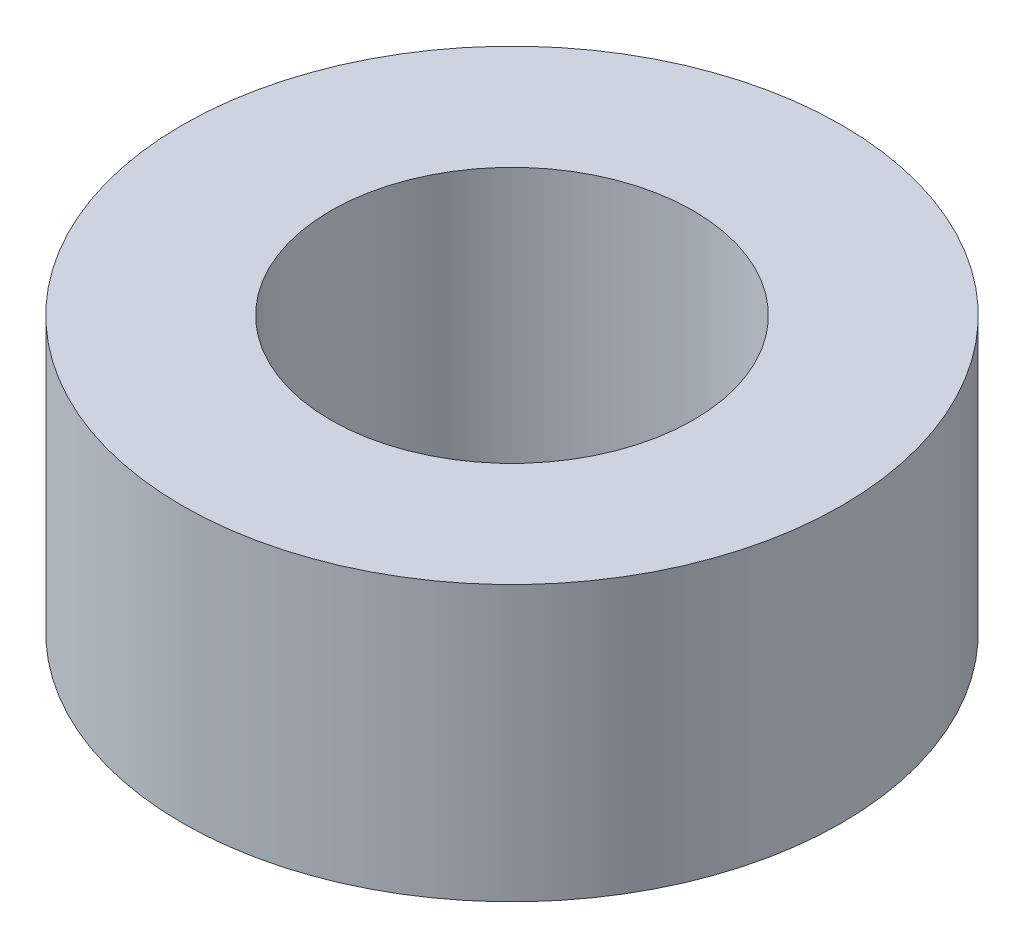
ISO-10303-21;
HEADER;
FILE_DESCRIPTION(('STEP AP214'),'2;1');
FILE_NAME('part.step','',(''),(''),'','','');
FILE_SCHEMA(('AUTOMOTIVE_DESIGN { 1 0 10303 214 1 1 1 1 }'));
ENDSEC;
DATA;
#1=APPLICATION_CONTEXT('core data for automotive mechanical design processes');
#2=APPLICATION_PROTOCOL_DEFINITION('international standard','automotive_design',2000,#1);
#3=PRODUCT_CONTEXT('',#1,'mechanical');
#4=PRODUCT('Part','Part','',(#3));
#5=PRODUCT_RELATED_PRODUCT_CATEGORY('part','',(#4));
#6=PRODUCT_DEFINITION_FORMATION('','',#4);
#7=PRODUCT_DEFINITION_CONTEXT('part definition',#1,'design');
#8=PRODUCT_DEFINITION('design','',#6,#7);
#9=PRODUCT_DEFINITION_SHAPE('','',#8);
#10=(LENGTH_UNIT() NAMED_UNIT(*) SI_UNIT(.MILLI.,.METRE.));
#11=(NAMED_UNIT(*) PLANE_ANGLE_UNIT() SI_UNIT($,.RADIAN.));
#12=(NAMED_UNIT(*) SI_UNIT($,.STERADIAN.) SOLID_ANGLE_UNIT());
#13=UNCERTAINTY_MEASURE_WITH_UNIT(LENGTH_MEASURE(1.E-05),#10,'distance_accuracy_value','');
#14=(GEOMETRIC_REPRESENTATION_CONTEXT(3) GLOBAL_UNCERTAINTY_ASSIGNED_CONTEXT((#13)) GLOBAL_UNIT_ASSIGNED_CONTEXT((#10,
#11,#12)) REPRESENTATION_CONTEXT('',''));
#15=CARTESIAN_POINT('',(0.,0.,0.));
#16=DIRECTION('',(0.,0.,1.));
#17=DIRECTION('',(1.,0.,0.));
#18=AXIS2_PLACEMENT_3D('',#15,#16,#17);
#19=CARTESIAN_POINT('',(0.,5.,0.));
#20=DIRECTION('',(0.,1.,0.));
#21=DIRECTION('',(0.,0.,1.));
#22=AXIS2_PLACEMENT_3D('',#19,#20,#21);
#23=PLANE('',#22);
#24=CARTESIAN_POINT('',(0.,5.,0.));
#25=DIRECTION('',(0.,1.,0.));
#26=DIRECTION('',(0.,0.,1.));
#27=AXIS2_PLACEMENT_3D('',#24,#25,#26);
#28=CIRCLE('',#27,6.);
#29=CARTESIAN_POINT('',(0.,5.,6.));
#30=VERTEX_POINT('',#29);
#31=EDGE_CURVE('E11',#30,#30,#28,.T.);
#32=ORIENTED_EDGE('',*,*,#31,.T.);
#33=EDGE_LOOP('',(#32));
#34=FACE_BOUND('',#33,.T.);
#35=CARTESIAN_POINT('',(0.,5.,0.));
#36=DIRECTION('',(0.,1.,0.));
#37=DIRECTION('',(0.,0.,1.));
#38=AXIS2_PLACEMENT_3D('',#35,#36,#37);
#39=CIRCLE('',#38,3.29999999999986);
#40=CARTESIAN_POINT('',(0.,5.,3.29999999999986));
#41=VERTEX_POINT('',#40);
#42=EDGE_CURVE('E54',#41,#41,#39,.T.);
#43=ORIENTED_EDGE('',*,*,#42,.F.);
#44=EDGE_LOOP('',(#43));
#45=FACE_BOUND('',#44,.T.);
#46=ADVANCED_FACE('F43',(#34,#45),#23,.T.);
#47=CARTESIAN_POINT('',(0.,0.,0.));
#48=DIRECTION('',(0.,1.,0.));
#49=DIRECTION('',(0.,0.,1.));
#50=AXIS2_PLACEMENT_3D('',#47,#48,#49);
#51=PLANE('',#50);
#52=CARTESIAN_POINT('',(0.,0.,0.));
#53=DIRECTION('',(0.,1.,0.));
#54=DIRECTION('',(0.,0.,1.));
#55=AXIS2_PLACEMENT_3D('',#52,#53,#54);
#56=CIRCLE('',#55,6.);
#57=CARTESIAN_POINT('',(0.,0.,6.));
#58=VERTEX_POINT('',#57);
#59=EDGE_CURVE('E47',#58,#58,#56,.T.);
#60=ORIENTED_EDGE('',*,*,#59,.F.);
#61=EDGE_LOOP('',(#60));
#62=FACE_BOUND('',#61,.T.);
#63=CARTESIAN_POINT('',(0.,0.,0.));
#64=DIRECTION('',(0.,1.,0.));
#65=DIRECTION('',(0.,0.,1.));
#66=AXIS2_PLACEMENT_3D('',#63,#64,#65);
#67=CIRCLE('',#66,3.29999999999986);
#68=CARTESIAN_POINT('',(0.,0.,3.29999999999986));
#69=VERTEX_POINT('',#68);
#70=EDGE_CURVE('E56',#69,#69,#67,.T.);
#71=ORIENTED_EDGE('',*,*,#70,.T.);
#72=EDGE_LOOP('',(#71));
#73=FACE_BOUND('',#72,.T.);
#74=ADVANCED_FACE('F66',(#62,#73),#51,.F.);
#75=CARTESIAN_POINT('',(0.,5.,0.));
#76=DIRECTION('',(0.,-1.,0.));
#77=DIRECTION('',(0.,0.,-1.));
#78=AXIS2_PLACEMENT_3D('',#75,#76,#77);
#79=CYLINDRICAL_SURFACE('',#78,6.);
#80=ORIENTED_EDGE('',*,*,#31,.F.);
#81=EDGE_LOOP('',(#80));
#82=FACE_BOUND('',#81,.T.);
#83=ORIENTED_EDGE('',*,*,#59,.T.);
#84=EDGE_LOOP('',(#83));
#85=FACE_BOUND('',#84,.T.);
#86=ADVANCED_FACE('F45',(#82,#85),#79,.T.);
#87=CARTESIAN_POINT('',(0.,5.,0.));
#88=DIRECTION('',(0.,-1.,0.));
#89=DIRECTION('',(0.,0.,-1.));
#90=AXIS2_PLACEMENT_3D('',#87,#88,#89);
#91=CYLINDRICAL_SURFACE('',#90,3.29999999999986);
#92=ORIENTED_EDGE('',*,*,#42,.T.);
#93=EDGE_LOOP('',(#92));
#94=FACE_BOUND('',#93,.T.);
#95=ORIENTED_EDGE('',*,*,#70,.F.);
#96=EDGE_LOOP('',(#95));
#97=FACE_BOUND('',#96,.T.);
#98=ADVANCED_FACE('F62',(#94,#97),#91,.F.);
#99=CLOSED_SHELL('',(#46,#74,#86,#98));
#100=MANIFOLD_SOLID_BREP('B2',#99);
#101=ADVANCED_BREP_SHAPE_REPRESENTATION('',(#18,#100),#14);
#102=SHAPE_DEFINITION_REPRESENTATION(#9,#101);
ENDSEC;
END-ISO-10303-21;
